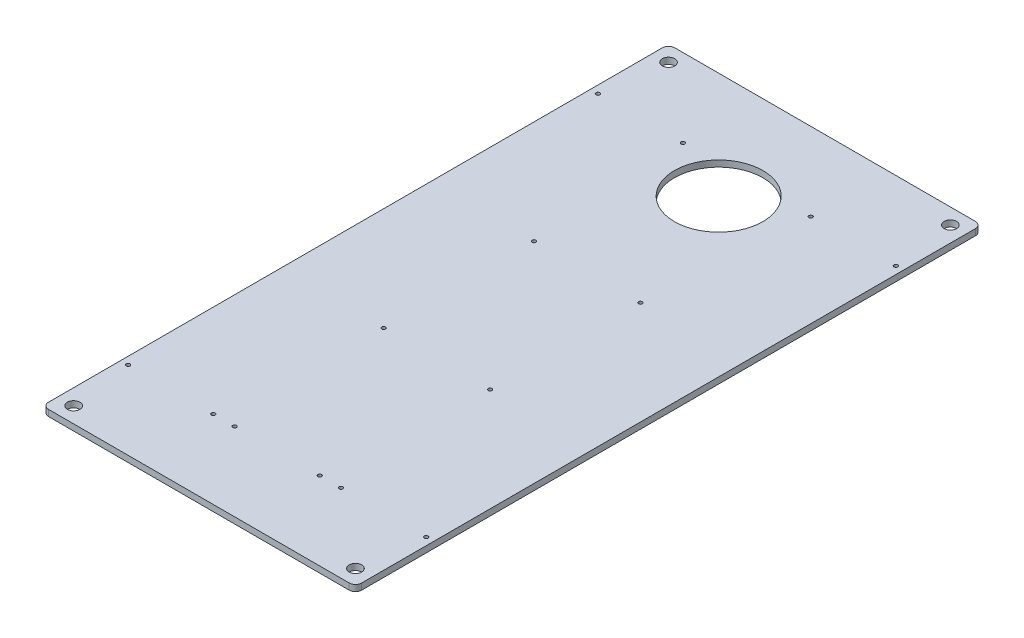
ISO-10303-21;
HEADER;
FILE_DESCRIPTION(('STEP AP214'),'2;1');
FILE_NAME('part.step','',(''),(''),'','','');
FILE_SCHEMA(('AUTOMOTIVE_DESIGN { 1 0 10303 214 1 1 1 1 }'));
ENDSEC;
DATA;
#1=APPLICATION_CONTEXT('core data for automotive mechanical design processes');
#2=APPLICATION_PROTOCOL_DEFINITION('international standard','automotive_design',2000,#1);
#3=PRODUCT_CONTEXT('',#1,'mechanical');
#4=PRODUCT('Part','Part','',(#3));
#5=PRODUCT_RELATED_PRODUCT_CATEGORY('part','',(#4));
#6=PRODUCT_DEFINITION_FORMATION('','',#4);
#7=PRODUCT_DEFINITION_CONTEXT('part definition',#1,'design');
#8=PRODUCT_DEFINITION('design','',#6,#7);
#9=PRODUCT_DEFINITION_SHAPE('','',#8);
#10=(LENGTH_UNIT() NAMED_UNIT(*) SI_UNIT(.MILLI.,.METRE.));
#11=(NAMED_UNIT(*) PLANE_ANGLE_UNIT() SI_UNIT($,.RADIAN.));
#12=(NAMED_UNIT(*) SI_UNIT($,.STERADIAN.) SOLID_ANGLE_UNIT());
#13=UNCERTAINTY_MEASURE_WITH_UNIT(LENGTH_MEASURE(1.E-05),#10,'distance_accuracy_value','');
#14=(GEOMETRIC_REPRESENTATION_CONTEXT(3) GLOBAL_UNCERTAINTY_ASSIGNED_CONTEXT((#13)) GLOBAL_UNIT_ASSIGNED_CONTEXT((#10,
#11,#12)) REPRESENTATION_CONTEXT('',''));
#15=CARTESIAN_POINT('',(0.,0.,0.));
#16=DIRECTION('',(0.,0.,1.));
#17=DIRECTION('',(1.,0.,0.));
#18=AXIS2_PLACEMENT_3D('',#15,#16,#17);
#19=CARTESIAN_POINT('',(250.,10.,500.));
#20=DIRECTION('',(-1.,0.,0.));
#21=DIRECTION('',(0.,0.,1.));
#22=AXIS2_PLACEMENT_3D('',#19,#20,#21);
#23=PLANE('',#22);
#24=DIRECTION('',(0.,0.,-1.));
#25=VECTOR('',#24,1.);
#26=CARTESIAN_POINT('',(250.,0.,500.));
#27=LINE('',#26,#25);
#28=CARTESIAN_POINT('',(250.,0.,490.));
#29=VERTEX_POINT('',#28);
#30=CARTESIAN_POINT('',(250.,0.,-490.));
#31=VERTEX_POINT('',#30);
#32=EDGE_CURVE('E158',#29,#31,#27,.T.);
#33=ORIENTED_EDGE('',*,*,#32,.T.);
#34=DIRECTION('',(0.,-1.,0.));
#35=VECTOR('',#34,1.);
#36=CARTESIAN_POINT('',(250.,10.,-490.));
#37=LINE('',#36,#35);
#38=CARTESIAN_POINT('',(250.,10.,-490.));
#39=VERTEX_POINT('',#38);
#40=EDGE_CURVE('E11',#31,#39,#37,.F.);
#41=ORIENTED_EDGE('',*,*,#40,.T.);
#42=DIRECTION('',(0.,0.,-1.));
#43=VECTOR('',#42,1.);
#44=CARTESIAN_POINT('',(250.,10.,500.));
#45=LINE('',#44,#43);
#46=CARTESIAN_POINT('',(250.,10.,490.));
#47=VERTEX_POINT('',#46);
#48=EDGE_CURVE('E126',#47,#39,#45,.T.);
#49=ORIENTED_EDGE('',*,*,#48,.F.);
#50=DIRECTION('',(0.,-1.,0.));
#51=VECTOR('',#50,1.);
#52=CARTESIAN_POINT('',(250.,10.,490.));
#53=LINE('',#52,#51);
#54=EDGE_CURVE('E42',#47,#29,#53,.T.);
#55=ORIENTED_EDGE('',*,*,#54,.T.);
#56=EDGE_LOOP('',(#33,#41,#49,#55));
#57=FACE_BOUND('',#56,.T.);
#58=ADVANCED_FACE('F34',(#57),#23,.F.);
#59=CARTESIAN_POINT('',(-250.,10.,-500.));
#60=DIRECTION('',(0.,0.,1.));
#61=DIRECTION('',(1.,0.,0.));
#62=AXIS2_PLACEMENT_3D('',#59,#60,#61);
#63=PLANE('',#62);
#64=DIRECTION('',(-1.,0.,0.));
#65=VECTOR('',#64,1.);
#66=CARTESIAN_POINT('',(-250.,0.,-500.));
#67=LINE('',#66,#65);
#68=CARTESIAN_POINT('',(240.,0.,-500.));
#69=VERTEX_POINT('',#68);
#70=CARTESIAN_POINT('',(-240.,0.,-500.));
#71=VERTEX_POINT('',#70);
#72=EDGE_CURVE('E131',#69,#71,#67,.T.);
#73=ORIENTED_EDGE('',*,*,#72,.T.);
#74=DIRECTION('',(0.,-1.,0.));
#75=VECTOR('',#74,1.);
#76=CARTESIAN_POINT('',(-240.,10.,-500.));
#77=LINE('',#76,#75);
#78=CARTESIAN_POINT('',(-240.,10.,-500.));
#79=VERTEX_POINT('',#78);
#80=EDGE_CURVE('E49',#71,#79,#77,.F.);
#81=ORIENTED_EDGE('',*,*,#80,.T.);
#82=DIRECTION('',(-1.,0.,0.));
#83=VECTOR('',#82,1.);
#84=CARTESIAN_POINT('',(-250.,10.,-500.));
#85=LINE('',#84,#83);
#86=CARTESIAN_POINT('',(240.,10.,-500.));
#87=VERTEX_POINT('',#86);
#88=EDGE_CURVE('E129',#87,#79,#85,.T.);
#89=ORIENTED_EDGE('',*,*,#88,.F.);
#90=DIRECTION('',(0.,-1.,0.));
#91=VECTOR('',#90,1.);
#92=CARTESIAN_POINT('',(240.,10.,-500.));
#93=LINE('',#92,#91);
#94=EDGE_CURVE('E150',#87,#69,#93,.T.);
#95=ORIENTED_EDGE('',*,*,#94,.T.);
#96=EDGE_LOOP('',(#73,#81,#89,#95));
#97=FACE_BOUND('',#96,.T.);
#98=ADVANCED_FACE('F324',(#97),#63,.F.);
#99=CARTESIAN_POINT('',(-250.,10.,500.));
#100=DIRECTION('',(1.,0.,0.));
#101=DIRECTION('',(0.,0.,-1.));
#102=AXIS2_PLACEMENT_3D('',#99,#100,#101);
#103=PLANE('',#102);
#104=DIRECTION('',(0.,0.,1.));
#105=VECTOR('',#104,1.);
#106=CARTESIAN_POINT('',(-250.,0.,500.));
#107=LINE('',#106,#105);
#108=CARTESIAN_POINT('',(-250.,0.,-490.));
#109=VERTEX_POINT('',#108);
#110=CARTESIAN_POINT('',(-250.,0.,490.));
#111=VERTEX_POINT('',#110);
#112=EDGE_CURVE('E127',#109,#111,#107,.T.);
#113=ORIENTED_EDGE('',*,*,#112,.T.);
#114=DIRECTION('',(0.,-1.,0.));
#115=VECTOR('',#114,1.);
#116=CARTESIAN_POINT('',(-250.,10.,490.));
#117=LINE('',#116,#115);
#118=CARTESIAN_POINT('',(-250.,10.,490.));
#119=VERTEX_POINT('',#118);
#120=EDGE_CURVE('E105',#111,#119,#117,.F.);
#121=ORIENTED_EDGE('',*,*,#120,.T.);
#122=DIRECTION('',(0.,0.,1.));
#123=VECTOR('',#122,1.);
#124=CARTESIAN_POINT('',(-250.,10.,500.));
#125=LINE('',#124,#123);
#126=CARTESIAN_POINT('',(-250.,10.,-490.));
#127=VERTEX_POINT('',#126);
#128=EDGE_CURVE('E170',#127,#119,#125,.T.);
#129=ORIENTED_EDGE('',*,*,#128,.F.);
#130=DIRECTION('',(0.,-1.,0.));
#131=VECTOR('',#130,1.);
#132=CARTESIAN_POINT('',(-250.,10.,-490.));
#133=LINE('',#132,#131);
#134=EDGE_CURVE('E110',#127,#109,#133,.T.);
#135=ORIENTED_EDGE('',*,*,#134,.T.);
#136=EDGE_LOOP('',(#113,#121,#129,#135));
#137=FACE_BOUND('',#136,.T.);
#138=ADVANCED_FACE('F321',(#137),#103,.F.);
#139=CARTESIAN_POINT('',(-250.,10.,500.));
#140=DIRECTION('',(0.,0.,-1.));
#141=DIRECTION('',(-1.,0.,0.));
#142=AXIS2_PLACEMENT_3D('',#139,#140,#141);
#143=PLANE('',#142);
#144=DIRECTION('',(1.,0.,0.));
#145=VECTOR('',#144,1.);
#146=CARTESIAN_POINT('',(-250.,10.,500.));
#147=LINE('',#146,#145);
#148=CARTESIAN_POINT('',(-240.,10.,500.));
#149=VERTEX_POINT('',#148);
#150=CARTESIAN_POINT('',(240.,10.,500.));
#151=VERTEX_POINT('',#150);
#152=EDGE_CURVE('E120',#149,#151,#147,.T.);
#153=ORIENTED_EDGE('',*,*,#152,.F.);
#154=DIRECTION('',(0.,-1.,0.));
#155=VECTOR('',#154,1.);
#156=CARTESIAN_POINT('',(-240.,10.,500.));
#157=LINE('',#156,#155);
#158=CARTESIAN_POINT('',(-240.,0.,500.));
#159=VERTEX_POINT('',#158);
#160=EDGE_CURVE('E104',#149,#159,#157,.T.);
#161=ORIENTED_EDGE('',*,*,#160,.T.);
#162=DIRECTION('',(1.,0.,0.));
#163=VECTOR('',#162,1.);
#164=CARTESIAN_POINT('',(-250.,0.,500.));
#165=LINE('',#164,#163);
#166=CARTESIAN_POINT('',(240.,0.,500.));
#167=VERTEX_POINT('',#166);
#168=EDGE_CURVE('E117',#159,#167,#165,.T.);
#169=ORIENTED_EDGE('',*,*,#168,.T.);
#170=DIRECTION('',(0.,-1.,0.));
#171=VECTOR('',#170,1.);
#172=CARTESIAN_POINT('',(240.,10.,500.));
#173=LINE('',#172,#171);
#174=EDGE_CURVE('E122',#167,#151,#173,.F.);
#175=ORIENTED_EDGE('',*,*,#174,.T.);
#176=EDGE_LOOP('',(#153,#161,#169,#175));
#177=FACE_BOUND('',#176,.T.);
#178=ADVANCED_FACE('F116',(#177),#143,.F.);
#179=CARTESIAN_POINT('',(0.,10.,0.));
#180=DIRECTION('',(0.,-1.,0.));
#181=DIRECTION('',(0.,0.,-1.));
#182=AXIS2_PLACEMENT_3D('',#179,#180,#181);
#183=PLANE('',#182);
#184=CARTESIAN_POINT('',(238.,10.,-375.));
#185=DIRECTION('',(0.,1.,0.));
#186=DIRECTION('',(0.,0.,-1.));
#187=AXIS2_PLACEMENT_3D('',#184,#185,#186);
#188=CIRCLE('',#187,2.99999999999999);
#189=CARTESIAN_POINT('',(238.,10.,-378.));
#190=VERTEX_POINT('',#189);
#191=EDGE_CURVE('E234',#190,#190,#188,.T.);
#192=ORIENTED_EDGE('',*,*,#191,.F.);
#193=EDGE_LOOP('',(#192));
#194=FACE_BOUND('',#193,.T.);
#195=CARTESIAN_POINT('',(68.,10.,375.));
#196=DIRECTION('',(0.,1.,0.));
#197=DIRECTION('',(0.,0.,1.));
#198=AXIS2_PLACEMENT_3D('',#195,#196,#197);
#199=CIRCLE('',#198,3.00000000000001);
#200=CARTESIAN_POINT('',(68.,10.,378.));
#201=VERTEX_POINT('',#200);
#202=EDGE_CURVE('E228',#201,#201,#199,.T.);
#203=ORIENTED_EDGE('',*,*,#202,.F.);
#204=EDGE_LOOP('',(#203));
#205=FACE_BOUND('',#204,.T.);
#206=CARTESIAN_POINT('',(102.,10.,375.));
#207=DIRECTION('',(0.,1.,0.));
#208=DIRECTION('',(0.,0.,-1.));
#209=AXIS2_PLACEMENT_3D('',#206,#207,#208);
#210=CIRCLE('',#209,2.99999999999999);
#211=CARTESIAN_POINT('',(102.,10.,372.));
#212=VERTEX_POINT('',#211);
#213=EDGE_CURVE('E254',#212,#212,#210,.T.);
#214=ORIENTED_EDGE('',*,*,#213,.F.);
#215=EDGE_LOOP('',(#214));
#216=FACE_BOUND('',#215,.T.);
#217=CARTESIAN_POINT('',(-68.,10.,375.));
#218=DIRECTION('',(0.,1.,0.));
#219=DIRECTION('',(0.,0.,1.));
#220=AXIS2_PLACEMENT_3D('',#217,#218,#219);
#221=CIRCLE('',#220,3.00000000000001);
#222=CARTESIAN_POINT('',(-68.,10.,378.));
#223=VERTEX_POINT('',#222);
#224=EDGE_CURVE('E248',#223,#223,#221,.T.);
#225=ORIENTED_EDGE('',*,*,#224,.F.);
#226=EDGE_LOOP('',(#225));
#227=FACE_BOUND('',#226,.T.);
#228=CARTESIAN_POINT('',(-102.,10.,375.));
#229=DIRECTION('',(0.,1.,0.));
#230=DIRECTION('',(0.,0.,1.));
#231=AXIS2_PLACEMENT_3D('',#228,#229,#230);
#232=CIRCLE('',#231,2.99999999999999);
#233=CARTESIAN_POINT('',(-102.,10.,378.));
#234=VERTEX_POINT('',#233);
#235=EDGE_CURVE('E241',#234,#234,#232,.T.);
#236=ORIENTED_EDGE('',*,*,#235,.F.);
#237=EDGE_LOOP('',(#236));
#238=FACE_BOUND('',#237,.T.);
#239=CARTESIAN_POINT('',(-238.,10.,375.));
#240=DIRECTION('',(0.,1.,0.));
#241=DIRECTION('',(0.,0.,-1.));
#242=AXIS2_PLACEMENT_3D('',#239,#240,#241);
#243=CIRCLE('',#242,2.99999999999999);
#244=CARTESIAN_POINT('',(-238.,10.,372.));
#245=VERTEX_POINT('',#244);
#246=EDGE_CURVE('E242',#245,#245,#243,.T.);
#247=ORIENTED_EDGE('',*,*,#246,.F.);
#248=EDGE_LOOP('',(#247));
#249=FACE_BOUND('',#248,.T.);
#250=CARTESIAN_POINT('',(-238.,10.,-375.));
#251=DIRECTION('',(0.,1.,0.));
#252=DIRECTION('',(0.,0.,1.));
#253=AXIS2_PLACEMENT_3D('',#250,#251,#252);
#254=CIRCLE('',#253,2.99999999999999);
#255=CARTESIAN_POINT('',(-238.,10.,-372.));
#256=VERTEX_POINT('',#255);
#257=EDGE_CURVE('E276',#256,#256,#254,.T.);
#258=ORIENTED_EDGE('',*,*,#257,.F.);
#259=EDGE_LOOP('',(#258));
#260=FACE_BOUND('',#259,.T.);
#261=CARTESIAN_POINT('',(-102.,10.,-375.));
#262=DIRECTION('',(0.,1.,0.));
#263=DIRECTION('',(0.,0.,-1.));
#264=AXIS2_PLACEMENT_3D('',#261,#262,#263);
#265=CIRCLE('',#264,2.99999999999999);
#266=CARTESIAN_POINT('',(-102.,10.,-378.));
#267=VERTEX_POINT('',#266);
#268=EDGE_CURVE('E270',#267,#267,#265,.T.);
#269=ORIENTED_EDGE('',*,*,#268,.F.);
#270=EDGE_LOOP('',(#269));
#271=FACE_BOUND('',#270,.T.);
#272=CARTESIAN_POINT('',(102.,10.,-375.));
#273=DIRECTION('',(0.,1.,0.));
#274=DIRECTION('',(0.,0.,1.));
#275=AXIS2_PLACEMENT_3D('',#272,#273,#274);
#276=CIRCLE('',#275,2.99999999999999);
#277=CARTESIAN_POINT('',(102.,10.,-372.));
#278=VERTEX_POINT('',#277);
#279=EDGE_CURVE('E264',#278,#278,#276,.T.);
#280=ORIENTED_EDGE('',*,*,#279,.F.);
#281=EDGE_LOOP('',(#280));
#282=FACE_BOUND('',#281,.T.);
#283=CARTESIAN_POINT('',(238.,10.,375.));
#284=DIRECTION('',(0.,1.,0.));
#285=DIRECTION('',(0.,0.,1.));
#286=AXIS2_PLACEMENT_3D('',#283,#284,#285);
#287=CIRCLE('',#286,2.99999999999999);
#288=CARTESIAN_POINT('',(238.,10.,378.));
#289=VERTEX_POINT('',#288);
#290=EDGE_CURVE('E211',#289,#289,#287,.T.);
#291=ORIENTED_EDGE('',*,*,#290,.F.);
#292=EDGE_LOOP('',(#291));
#293=FACE_BOUND('',#292,.T.);
#294=CARTESIAN_POINT('',(-85.,10.,120.));
#295=DIRECTION('',(0.,1.,0.));
#296=DIRECTION('',(0.,0.,1.));
#297=AXIS2_PLACEMENT_3D('',#294,#295,#296);
#298=CIRCLE('',#297,3.00000000000001);
#299=CARTESIAN_POINT('',(-85.,10.,123.));
#300=VERTEX_POINT('',#299);
#301=EDGE_CURVE('E210',#300,#300,#298,.T.);
#302=ORIENTED_EDGE('',*,*,#301,.F.);
#303=EDGE_LOOP('',(#302));
#304=FACE_BOUND('',#303,.T.);
#305=CARTESIAN_POINT('',(85.,10.,120.));
#306=DIRECTION('',(0.,1.,0.));
#307=DIRECTION('',(0.,0.,1.));
#308=AXIS2_PLACEMENT_3D('',#305,#306,#307);
#309=CIRCLE('',#308,3.00000000000001);
#310=CARTESIAN_POINT('',(85.,10.,123.));
#311=VERTEX_POINT('',#310);
#312=EDGE_CURVE('E217',#311,#311,#309,.T.);
#313=ORIENTED_EDGE('',*,*,#312,.F.);
#314=EDGE_LOOP('',(#313));
#315=FACE_BOUND('',#314,.T.);
#316=CARTESIAN_POINT('',(85.,10.,-120.));
#317=DIRECTION('',(0.,1.,0.));
#318=DIRECTION('',(0.,0.,1.));
#319=AXIS2_PLACEMENT_3D('',#316,#317,#318);
#320=CIRCLE('',#319,3.00000000000001);
#321=CARTESIAN_POINT('',(85.,10.,-117.));
#322=VERTEX_POINT('',#321);
#323=EDGE_CURVE('E204',#322,#322,#320,.T.);
#324=ORIENTED_EDGE('',*,*,#323,.F.);
#325=EDGE_LOOP('',(#324));
#326=FACE_BOUND('',#325,.T.);
#327=CARTESIAN_POINT('',(-85.,10.,-120.));
#328=DIRECTION('',(0.,1.,0.));
#329=DIRECTION('',(0.,0.,1.));
#330=AXIS2_PLACEMENT_3D('',#327,#328,#329);
#331=CIRCLE('',#330,3.00000000000001);
#332=CARTESIAN_POINT('',(-85.,10.,-117.));
#333=VERTEX_POINT('',#332);
#334=EDGE_CURVE('E198',#333,#333,#331,.T.);
#335=ORIENTED_EDGE('',*,*,#334,.F.);
#336=EDGE_LOOP('',(#335));
#337=FACE_BOUND('',#336,.T.);
#338=CARTESIAN_POINT('',(0.,10.,-330.));
#339=DIRECTION('',(0.,1.,0.));
#340=DIRECTION('',(0.,0.,1.));
#341=AXIS2_PLACEMENT_3D('',#338,#339,#340);
#342=CIRCLE('',#341,70.65);
#343=CARTESIAN_POINT('',(0.,10.,-259.35));
#344=VERTEX_POINT('',#343);
#345=EDGE_CURVE('E192',#344,#344,#342,.T.);
#346=ORIENTED_EDGE('',*,*,#345,.F.);
#347=EDGE_LOOP('',(#346));
#348=FACE_BOUND('',#347,.T.);
#349=CARTESIAN_POINT('',(225.,10.,-475.));
#350=DIRECTION('',(0.,1.,0.));
#351=DIRECTION('',(0.,0.,-1.));
#352=AXIS2_PLACEMENT_3D('',#349,#350,#351);
#353=CIRCLE('',#352,10.);
#354=CARTESIAN_POINT('',(225.,10.,-485.));
#355=VERTEX_POINT('',#354);
#356=EDGE_CURVE('E175',#355,#355,#353,.T.);
#357=ORIENTED_EDGE('',*,*,#356,.F.);
#358=EDGE_LOOP('',(#357));
#359=FACE_BOUND('',#358,.T.);
#360=CARTESIAN_POINT('',(-224.999999999999,10.,475.));
#361=DIRECTION('',(0.,1.,0.));
#362=DIRECTION('',(0.,0.,-1.));
#363=AXIS2_PLACEMENT_3D('',#360,#361,#362);
#364=CIRCLE('',#363,10.);
#365=CARTESIAN_POINT('',(-224.999999999999,10.,465.));
#366=VERTEX_POINT('',#365);
#367=EDGE_CURVE('E180',#366,#366,#364,.T.);
#368=ORIENTED_EDGE('',*,*,#367,.F.);
#369=EDGE_LOOP('',(#368));
#370=FACE_BOUND('',#369,.T.);
#371=CARTESIAN_POINT('',(225.000000000001,10.,475.));
#372=DIRECTION('',(0.,1.,0.));
#373=DIRECTION('',(0.,0.,1.));
#374=AXIS2_PLACEMENT_3D('',#371,#372,#373);
#375=CIRCLE('',#374,10.);
#376=CARTESIAN_POINT('',(225.000000000001,10.,485.));
#377=VERTEX_POINT('',#376);
#378=EDGE_CURVE('E181',#377,#377,#375,.T.);
#379=ORIENTED_EDGE('',*,*,#378,.F.);
#380=EDGE_LOOP('',(#379));
#381=FACE_BOUND('',#380,.T.);
#382=CARTESIAN_POINT('',(-225.,10.,-475.));
#383=DIRECTION('',(0.,1.,0.));
#384=DIRECTION('',(0.,0.,1.));
#385=AXIS2_PLACEMENT_3D('',#382,#383,#384);
#386=CIRCLE('',#385,10.);
#387=CARTESIAN_POINT('',(-225.,10.,-465.));
#388=VERTEX_POINT('',#387);
#389=EDGE_CURVE('E163',#388,#388,#386,.T.);
#390=ORIENTED_EDGE('',*,*,#389,.F.);
#391=EDGE_LOOP('',(#390));
#392=FACE_BOUND('',#391,.T.);
#393=ORIENTED_EDGE('',*,*,#128,.T.);
#394=CARTESIAN_POINT('',(-240.,10.,490.));
#395=DIRECTION('',(0.,-1.,0.));
#396=DIRECTION('',(0.,0.,-1.));
#397=AXIS2_PLACEMENT_3D('',#394,#395,#396);
#398=CIRCLE('',#397,10.);
#399=EDGE_CURVE('E148',#119,#149,#398,.F.);
#400=ORIENTED_EDGE('',*,*,#399,.T.);
#401=ORIENTED_EDGE('',*,*,#152,.T.);
#402=CARTESIAN_POINT('',(240.,10.,490.));
#403=DIRECTION('',(0.,-1.,0.));
#404=DIRECTION('',(0.,0.,-1.));
#405=AXIS2_PLACEMENT_3D('',#402,#403,#404);
#406=CIRCLE('',#405,10.);
#407=EDGE_CURVE('E143',#151,#47,#406,.F.);
#408=ORIENTED_EDGE('',*,*,#407,.T.);
#409=ORIENTED_EDGE('',*,*,#48,.T.);
#410=CARTESIAN_POINT('',(240.,10.,-490.));
#411=DIRECTION('',(0.,-1.,0.));
#412=DIRECTION('',(0.,0.,-1.));
#413=AXIS2_PLACEMENT_3D('',#410,#411,#412);
#414=CIRCLE('',#413,10.);
#415=EDGE_CURVE('E56',#39,#87,#414,.F.);
#416=ORIENTED_EDGE('',*,*,#415,.T.);
#417=ORIENTED_EDGE('',*,*,#88,.T.);
#418=CARTESIAN_POINT('',(-240.,10.,-490.));
#419=DIRECTION('',(0.,-1.,0.));
#420=DIRECTION('',(0.,0.,-1.));
#421=AXIS2_PLACEMENT_3D('',#418,#419,#420);
#422=CIRCLE('',#421,10.);
#423=EDGE_CURVE('E146',#79,#127,#422,.F.);
#424=ORIENTED_EDGE('',*,*,#423,.T.);
#425=EDGE_LOOP('',(#393,#400,#401,#408,#409,#416,#417,#424));
#426=FACE_BOUND('',#425,.T.);
#427=ADVANCED_FACE('F287',(#194,#205,#216,#227,#238,#249,#260,#271,#282,#293,#304,#315,#326,
#337,#348,#359,#370,#381,#392,#426),#183,.F.);
#428=CARTESIAN_POINT('',(0.,0.,0.));
#429=DIRECTION('',(0.,-1.,0.));
#430=DIRECTION('',(0.,0.,-1.));
#431=AXIS2_PLACEMENT_3D('',#428,#429,#430);
#432=PLANE('',#431);
#433=CARTESIAN_POINT('',(238.,0.,-375.));
#434=DIRECTION('',(0.,-1.,0.));
#435=DIRECTION('',(0.,0.,-1.));
#436=AXIS2_PLACEMENT_3D('',#433,#434,#435);
#437=CIRCLE('',#436,2.99999999999999);
#438=CARTESIAN_POINT('',(238.,0.,-378.));
#439=VERTEX_POINT('',#438);
#440=EDGE_CURVE('E231',#439,#439,#437,.F.);
#441=ORIENTED_EDGE('',*,*,#440,.T.);
#442=EDGE_LOOP('',(#441));
#443=FACE_BOUND('',#442,.T.);
#444=CARTESIAN_POINT('',(68.,0.,375.));
#445=DIRECTION('',(0.,-1.,0.));
#446=DIRECTION('',(0.,0.,-1.));
#447=AXIS2_PLACEMENT_3D('',#444,#445,#446);
#448=CIRCLE('',#447,3.00000000000001);
#449=CARTESIAN_POINT('',(68.,0.,372.));
#450=VERTEX_POINT('',#449);
#451=EDGE_CURVE('E257',#450,#450,#448,.F.);
#452=ORIENTED_EDGE('',*,*,#451,.T.);
#453=EDGE_LOOP('',(#452));
#454=FACE_BOUND('',#453,.T.);
#455=CARTESIAN_POINT('',(102.,0.,375.));
#456=DIRECTION('',(0.,-1.,0.));
#457=DIRECTION('',(0.,0.,-1.));
#458=AXIS2_PLACEMENT_3D('',#455,#456,#457);
#459=CIRCLE('',#458,2.99999999999999);
#460=CARTESIAN_POINT('',(102.,0.,372.));
#461=VERTEX_POINT('',#460);
#462=EDGE_CURVE('E251',#461,#461,#459,.F.);
#463=ORIENTED_EDGE('',*,*,#462,.T.);
#464=EDGE_LOOP('',(#463));
#465=FACE_BOUND('',#464,.T.);
#466=CARTESIAN_POINT('',(-68.,0.,375.));
#467=DIRECTION('',(0.,-1.,0.));
#468=DIRECTION('',(0.,0.,-1.));
#469=AXIS2_PLACEMENT_3D('',#466,#467,#468);
#470=CIRCLE('',#469,3.00000000000001);
#471=CARTESIAN_POINT('',(-68.,0.,372.));
#472=VERTEX_POINT('',#471);
#473=EDGE_CURVE('E245',#472,#472,#470,.F.);
#474=ORIENTED_EDGE('',*,*,#473,.T.);
#475=EDGE_LOOP('',(#474));
#476=FACE_BOUND('',#475,.T.);
#477=CARTESIAN_POINT('',(-102.,0.,375.));
#478=DIRECTION('',(0.,-1.,0.));
#479=DIRECTION('',(0.,0.,-1.));
#480=AXIS2_PLACEMENT_3D('',#477,#478,#479);
#481=CIRCLE('',#480,2.99999999999999);
#482=CARTESIAN_POINT('',(-102.,0.,372.));
#483=VERTEX_POINT('',#482);
#484=EDGE_CURVE('E238',#483,#483,#481,.F.);
#485=ORIENTED_EDGE('',*,*,#484,.T.);
#486=EDGE_LOOP('',(#485));
#487=FACE_BOUND('',#486,.T.);
#488=CARTESIAN_POINT('',(-238.,0.,375.));
#489=DIRECTION('',(0.,-1.,0.));
#490=DIRECTION('',(0.,0.,-1.));
#491=AXIS2_PLACEMENT_3D('',#488,#489,#490);
#492=CIRCLE('',#491,2.99999999999999);
#493=CARTESIAN_POINT('',(-238.,0.,372.));
#494=VERTEX_POINT('',#493);
#495=EDGE_CURVE('E279',#494,#494,#492,.F.);
#496=ORIENTED_EDGE('',*,*,#495,.T.);
#497=EDGE_LOOP('',(#496));
#498=FACE_BOUND('',#497,.T.);
#499=CARTESIAN_POINT('',(-238.,0.,-375.));
#500=DIRECTION('',(0.,-1.,0.));
#501=DIRECTION('',(0.,0.,-1.));
#502=AXIS2_PLACEMENT_3D('',#499,#500,#501);
#503=CIRCLE('',#502,2.99999999999999);
#504=CARTESIAN_POINT('',(-238.,0.,-378.));
#505=VERTEX_POINT('',#504);
#506=EDGE_CURVE('E273',#505,#505,#503,.F.);
#507=ORIENTED_EDGE('',*,*,#506,.T.);
#508=EDGE_LOOP('',(#507));
#509=FACE_BOUND('',#508,.T.);
#510=CARTESIAN_POINT('',(-102.,0.,-375.));
#511=DIRECTION('',(0.,-1.,0.));
#512=DIRECTION('',(0.,0.,-1.));
#513=AXIS2_PLACEMENT_3D('',#510,#511,#512);
#514=CIRCLE('',#513,2.99999999999999);
#515=CARTESIAN_POINT('',(-102.,0.,-378.));
#516=VERTEX_POINT('',#515);
#517=EDGE_CURVE('E267',#516,#516,#514,.F.);
#518=ORIENTED_EDGE('',*,*,#517,.T.);
#519=EDGE_LOOP('',(#518));
#520=FACE_BOUND('',#519,.T.);
#521=CARTESIAN_POINT('',(102.,0.,-375.));
#522=DIRECTION('',(0.,-1.,0.));
#523=DIRECTION('',(0.,0.,-1.));
#524=AXIS2_PLACEMENT_3D('',#521,#522,#523);
#525=CIRCLE('',#524,2.99999999999999);
#526=CARTESIAN_POINT('',(102.,0.,-378.));
#527=VERTEX_POINT('',#526);
#528=EDGE_CURVE('E237',#527,#527,#525,.F.);
#529=ORIENTED_EDGE('',*,*,#528,.T.);
#530=EDGE_LOOP('',(#529));
#531=FACE_BOUND('',#530,.T.);
#532=CARTESIAN_POINT('',(238.,0.,375.));
#533=DIRECTION('',(0.,-1.,0.));
#534=DIRECTION('',(0.,0.,-1.));
#535=AXIS2_PLACEMENT_3D('',#532,#533,#534);
#536=CIRCLE('',#535,2.99999999999999);
#537=CARTESIAN_POINT('',(238.,0.,372.));
#538=VERTEX_POINT('',#537);
#539=EDGE_CURVE('E225',#538,#538,#536,.F.);
#540=ORIENTED_EDGE('',*,*,#539,.T.);
#541=EDGE_LOOP('',(#540));
#542=FACE_BOUND('',#541,.T.);
#543=CARTESIAN_POINT('',(-85.,0.,120.));
#544=DIRECTION('',(0.,-1.,0.));
#545=DIRECTION('',(0.,0.,-1.));
#546=AXIS2_PLACEMENT_3D('',#543,#544,#545);
#547=CIRCLE('',#546,3.00000000000001);
#548=CARTESIAN_POINT('',(-85.,0.,117.));
#549=VERTEX_POINT('',#548);
#550=EDGE_CURVE('E207',#549,#549,#547,.F.);
#551=ORIENTED_EDGE('',*,*,#550,.T.);
#552=EDGE_LOOP('',(#551));
#553=FACE_BOUND('',#552,.T.);
#554=CARTESIAN_POINT('',(85.,0.,120.));
#555=DIRECTION('',(0.,-1.,0.));
#556=DIRECTION('',(0.,0.,-1.));
#557=AXIS2_PLACEMENT_3D('',#554,#555,#556);
#558=CIRCLE('',#557,3.00000000000001);
#559=CARTESIAN_POINT('',(85.,0.,117.));
#560=VERTEX_POINT('',#559);
#561=EDGE_CURVE('E214',#560,#560,#558,.F.);
#562=ORIENTED_EDGE('',*,*,#561,.T.);
#563=EDGE_LOOP('',(#562));
#564=FACE_BOUND('',#563,.T.);
#565=CARTESIAN_POINT('',(85.,0.,-120.));
#566=DIRECTION('',(0.,-1.,0.));
#567=DIRECTION('',(0.,0.,-1.));
#568=AXIS2_PLACEMENT_3D('',#565,#566,#567);
#569=CIRCLE('',#568,3.00000000000001);
#570=CARTESIAN_POINT('',(85.,0.,-123.));
#571=VERTEX_POINT('',#570);
#572=EDGE_CURVE('E220',#571,#571,#569,.F.);
#573=ORIENTED_EDGE('',*,*,#572,.T.);
#574=EDGE_LOOP('',(#573));
#575=FACE_BOUND('',#574,.T.);
#576=CARTESIAN_POINT('',(-85.,0.,-120.));
#577=DIRECTION('',(0.,-1.,0.));
#578=DIRECTION('',(0.,0.,-1.));
#579=AXIS2_PLACEMENT_3D('',#576,#577,#578);
#580=CIRCLE('',#579,3.00000000000001);
#581=CARTESIAN_POINT('',(-85.,0.,-123.));
#582=VERTEX_POINT('',#581);
#583=EDGE_CURVE('E201',#582,#582,#580,.F.);
#584=ORIENTED_EDGE('',*,*,#583,.T.);
#585=EDGE_LOOP('',(#584));
#586=FACE_BOUND('',#585,.T.);
#587=CARTESIAN_POINT('',(0.,0.,-330.));
#588=DIRECTION('',(0.,-1.,0.));
#589=DIRECTION('',(0.,0.,-1.));
#590=AXIS2_PLACEMENT_3D('',#587,#588,#589);
#591=CIRCLE('',#590,70.65);
#592=CARTESIAN_POINT('',(0.,0.,-400.65));
#593=VERTEX_POINT('',#592);
#594=EDGE_CURVE('E195',#593,#593,#591,.F.);
#595=ORIENTED_EDGE('',*,*,#594,.T.);
#596=EDGE_LOOP('',(#595));
#597=FACE_BOUND('',#596,.T.);
#598=CARTESIAN_POINT('',(225.,0.,-475.));
#599=DIRECTION('',(0.,-1.,0.));
#600=DIRECTION('',(0.,0.,-1.));
#601=AXIS2_PLACEMENT_3D('',#598,#599,#600);
#602=CIRCLE('',#601,10.);
#603=CARTESIAN_POINT('',(225.,0.,-485.));
#604=VERTEX_POINT('',#603);
#605=EDGE_CURVE('E184',#604,#604,#602,.F.);
#606=ORIENTED_EDGE('',*,*,#605,.T.);
#607=EDGE_LOOP('',(#606));
#608=FACE_BOUND('',#607,.T.);
#609=CARTESIAN_POINT('',(-224.999999999999,0.,475.));
#610=DIRECTION('',(0.,-1.,0.));
#611=DIRECTION('',(0.,0.,-1.));
#612=AXIS2_PLACEMENT_3D('',#609,#610,#611);
#613=CIRCLE('',#612,10.);
#614=CARTESIAN_POINT('',(-224.999999999999,0.,465.));
#615=VERTEX_POINT('',#614);
#616=EDGE_CURVE('E177',#615,#615,#613,.F.);
#617=ORIENTED_EDGE('',*,*,#616,.T.);
#618=EDGE_LOOP('',(#617));
#619=FACE_BOUND('',#618,.T.);
#620=CARTESIAN_POINT('',(225.000000000001,0.,475.));
#621=DIRECTION('',(0.,-1.,0.));
#622=DIRECTION('',(0.,0.,-1.));
#623=AXIS2_PLACEMENT_3D('',#620,#621,#622);
#624=CIRCLE('',#623,10.);
#625=CARTESIAN_POINT('',(225.000000000001,0.,465.));
#626=VERTEX_POINT('',#625);
#627=EDGE_CURVE('E189',#626,#626,#624,.F.);
#628=ORIENTED_EDGE('',*,*,#627,.T.);
#629=EDGE_LOOP('',(#628));
#630=FACE_BOUND('',#629,.T.);
#631=CARTESIAN_POINT('',(-225.,0.,-475.));
#632=DIRECTION('',(0.,-1.,0.));
#633=DIRECTION('',(0.,0.,-1.));
#634=AXIS2_PLACEMENT_3D('',#631,#632,#633);
#635=CIRCLE('',#634,10.);
#636=CARTESIAN_POINT('',(-225.,0.,-485.));
#637=VERTEX_POINT('',#636);
#638=EDGE_CURVE('E166',#637,#637,#635,.F.);
#639=ORIENTED_EDGE('',*,*,#638,.T.);
#640=EDGE_LOOP('',(#639));
#641=FACE_BOUND('',#640,.T.);
#642=ORIENTED_EDGE('',*,*,#168,.F.);
#643=CARTESIAN_POINT('',(-240.,0.,490.));
#644=DIRECTION('',(0.,-1.,0.));
#645=DIRECTION('',(0.,0.,-1.));
#646=AXIS2_PLACEMENT_3D('',#643,#644,#645);
#647=CIRCLE('',#646,10.);
#648=EDGE_CURVE('E100',#159,#111,#647,.T.);
#649=ORIENTED_EDGE('',*,*,#648,.T.);
#650=ORIENTED_EDGE('',*,*,#112,.F.);
#651=CARTESIAN_POINT('',(-240.,0.,-490.));
#652=DIRECTION('',(0.,-1.,0.));
#653=DIRECTION('',(0.,0.,-1.));
#654=AXIS2_PLACEMENT_3D('',#651,#652,#653);
#655=CIRCLE('',#654,10.);
#656=EDGE_CURVE('E111',#109,#71,#655,.T.);
#657=ORIENTED_EDGE('',*,*,#656,.T.);
#658=ORIENTED_EDGE('',*,*,#72,.F.);
#659=CARTESIAN_POINT('',(240.,0.,-490.));
#660=DIRECTION('',(0.,-1.,0.));
#661=DIRECTION('',(0.,0.,-1.));
#662=AXIS2_PLACEMENT_3D('',#659,#660,#661);
#663=CIRCLE('',#662,10.);
#664=EDGE_CURVE('E137',#69,#31,#663,.T.);
#665=ORIENTED_EDGE('',*,*,#664,.T.);
#666=ORIENTED_EDGE('',*,*,#32,.F.);
#667=CARTESIAN_POINT('',(240.,0.,490.));
#668=DIRECTION('',(0.,-1.,0.));
#669=DIRECTION('',(0.,0.,-1.));
#670=AXIS2_PLACEMENT_3D('',#667,#668,#669);
#671=CIRCLE('',#670,10.);
#672=EDGE_CURVE('E121',#29,#167,#671,.T.);
#673=ORIENTED_EDGE('',*,*,#672,.T.);
#674=EDGE_LOOP('',(#642,#649,#650,#657,#658,#665,#666,#673));
#675=FACE_BOUND('',#674,.T.);
#676=ADVANCED_FACE('F124',(#443,#454,#465,#476,#487,#498,#509,#520,#531,#542,#553,#564,#575,
#586,#597,#608,#619,#630,#641,#675),#432,.T.);
#677=CARTESIAN_POINT('',(-225.,-0.000999999999999265,-475.));
#678=DIRECTION('',(0.,1.,0.));
#679=DIRECTION('',(0.,0.,1.));
#680=AXIS2_PLACEMENT_3D('',#677,#678,#679);
#681=CYLINDRICAL_SURFACE('',#680,10.);
#682=ORIENTED_EDGE('',*,*,#638,.F.);
#683=EDGE_LOOP('',(#682));
#684=FACE_BOUND('',#683,.T.);
#685=ORIENTED_EDGE('',*,*,#389,.T.);
#686=EDGE_LOOP('',(#685));
#687=FACE_BOUND('',#686,.T.);
#688=ADVANCED_FACE('F427',(#684,#687),#681,.F.);
#689=CARTESIAN_POINT('',(225.000000000001,-0.000999999999999265,475.));
#690=DIRECTION('',(0.,1.,0.));
#691=DIRECTION('',(0.,0.,1.));
#692=AXIS2_PLACEMENT_3D('',#689,#690,#691);
#693=CYLINDRICAL_SURFACE('',#692,10.);
#694=ORIENTED_EDGE('',*,*,#627,.F.);
#695=EDGE_LOOP('',(#694));
#696=FACE_BOUND('',#695,.T.);
#697=ORIENTED_EDGE('',*,*,#378,.T.);
#698=EDGE_LOOP('',(#697));
#699=FACE_BOUND('',#698,.T.);
#700=ADVANCED_FACE('F533',(#696,#699),#693,.F.);
#701=CARTESIAN_POINT('',(-224.999999999999,-0.000999999999999265,475.));
#702=DIRECTION('',(0.,1.,0.));
#703=DIRECTION('',(0.,0.,1.));
#704=AXIS2_PLACEMENT_3D('',#701,#702,#703);
#705=CYLINDRICAL_SURFACE('',#704,10.);
#706=ORIENTED_EDGE('',*,*,#616,.F.);
#707=EDGE_LOOP('',(#706));
#708=FACE_BOUND('',#707,.T.);
#709=ORIENTED_EDGE('',*,*,#367,.T.);
#710=EDGE_LOOP('',(#709));
#711=FACE_BOUND('',#710,.T.);
#712=ADVANCED_FACE('F536',(#708,#711),#705,.F.);
#713=CARTESIAN_POINT('',(225.,-0.000999999999999265,-475.));
#714=DIRECTION('',(0.,1.,0.));
#715=DIRECTION('',(0.,0.,1.));
#716=AXIS2_PLACEMENT_3D('',#713,#714,#715);
#717=CYLINDRICAL_SURFACE('',#716,10.);
#718=ORIENTED_EDGE('',*,*,#605,.F.);
#719=EDGE_LOOP('',(#718));
#720=FACE_BOUND('',#719,.T.);
#721=ORIENTED_EDGE('',*,*,#356,.T.);
#722=EDGE_LOOP('',(#721));
#723=FACE_BOUND('',#722,.T.);
#724=ADVANCED_FACE('F347',(#720,#723),#717,.F.);
#725=CARTESIAN_POINT('',(-240.,10.,490.));
#726=DIRECTION('',(0.,-1.,0.));
#727=DIRECTION('',(0.,0.,-1.));
#728=AXIS2_PLACEMENT_3D('',#725,#726,#727);
#729=CYLINDRICAL_SURFACE('',#728,10.);
#730=ORIENTED_EDGE('',*,*,#399,.F.);
#731=ORIENTED_EDGE('',*,*,#120,.F.);
#732=ORIENTED_EDGE('',*,*,#648,.F.);
#733=ORIENTED_EDGE('',*,*,#160,.F.);
#734=EDGE_LOOP('',(#730,#731,#732,#733));
#735=FACE_BOUND('',#734,.T.);
#736=ADVANCED_FACE('F103',(#735),#729,.T.);
#737=CARTESIAN_POINT('',(-240.,10.,-490.));
#738=DIRECTION('',(0.,-1.,0.));
#739=DIRECTION('',(0.,0.,-1.));
#740=AXIS2_PLACEMENT_3D('',#737,#738,#739);
#741=CYLINDRICAL_SURFACE('',#740,10.);
#742=ORIENTED_EDGE('',*,*,#423,.F.);
#743=ORIENTED_EDGE('',*,*,#80,.F.);
#744=ORIENTED_EDGE('',*,*,#656,.F.);
#745=ORIENTED_EDGE('',*,*,#134,.F.);
#746=EDGE_LOOP('',(#742,#743,#744,#745));
#747=FACE_BOUND('',#746,.T.);
#748=ADVANCED_FACE('F323',(#747),#741,.T.);
#749=CARTESIAN_POINT('',(240.,10.,-490.));
#750=DIRECTION('',(0.,-1.,0.));
#751=DIRECTION('',(0.,0.,-1.));
#752=AXIS2_PLACEMENT_3D('',#749,#750,#751);
#753=CYLINDRICAL_SURFACE('',#752,10.);
#754=ORIENTED_EDGE('',*,*,#415,.F.);
#755=ORIENTED_EDGE('',*,*,#40,.F.);
#756=ORIENTED_EDGE('',*,*,#664,.F.);
#757=ORIENTED_EDGE('',*,*,#94,.F.);
#758=EDGE_LOOP('',(#754,#755,#756,#757));
#759=FACE_BOUND('',#758,.T.);
#760=ADVANCED_FACE('F327',(#759),#753,.T.);
#761=CARTESIAN_POINT('',(240.,10.,490.));
#762=DIRECTION('',(0.,-1.,0.));
#763=DIRECTION('',(0.,0.,-1.));
#764=AXIS2_PLACEMENT_3D('',#761,#762,#763);
#765=CYLINDRICAL_SURFACE('',#764,10.);
#766=ORIENTED_EDGE('',*,*,#407,.F.);
#767=ORIENTED_EDGE('',*,*,#174,.F.);
#768=ORIENTED_EDGE('',*,*,#672,.F.);
#769=ORIENTED_EDGE('',*,*,#54,.F.);
#770=EDGE_LOOP('',(#766,#767,#768,#769));
#771=FACE_BOUND('',#770,.T.);
#772=ADVANCED_FACE('F36',(#771),#765,.T.);
#773=CARTESIAN_POINT('',(0.,-0.000999999999999265,-330.));
#774=DIRECTION('',(0.,1.,0.));
#775=DIRECTION('',(0.,0.,1.));
#776=AXIS2_PLACEMENT_3D('',#773,#774,#775);
#777=CYLINDRICAL_SURFACE('',#776,70.65);
#778=ORIENTED_EDGE('',*,*,#594,.F.);
#779=EDGE_LOOP('',(#778));
#780=FACE_BOUND('',#779,.T.);
#781=ORIENTED_EDGE('',*,*,#345,.T.);
#782=EDGE_LOOP('',(#781));
#783=FACE_BOUND('',#782,.T.);
#784=ADVANCED_FACE('F329',(#780,#783),#777,.F.);
#785=CARTESIAN_POINT('',(-85.,-0.000999999999999265,-120.));
#786=DIRECTION('',(0.,1.,0.));
#787=DIRECTION('',(0.,0.,1.));
#788=AXIS2_PLACEMENT_3D('',#785,#786,#787);
#789=CYLINDRICAL_SURFACE('',#788,3.00000000000001);
#790=ORIENTED_EDGE('',*,*,#583,.F.);
#791=EDGE_LOOP('',(#790));
#792=FACE_BOUND('',#791,.T.);
#793=ORIENTED_EDGE('',*,*,#334,.T.);
#794=EDGE_LOOP('',(#793));
#795=FACE_BOUND('',#794,.T.);
#796=ADVANCED_FACE('F334',(#792,#795),#789,.F.);
#797=CARTESIAN_POINT('',(85.,-0.000999999999999265,-120.));
#798=DIRECTION('',(0.,1.,0.));
#799=DIRECTION('',(0.,0.,1.));
#800=AXIS2_PLACEMENT_3D('',#797,#798,#799);
#801=CYLINDRICAL_SURFACE('',#800,3.00000000000001);
#802=ORIENTED_EDGE('',*,*,#572,.F.);
#803=EDGE_LOOP('',(#802));
#804=FACE_BOUND('',#803,.T.);
#805=ORIENTED_EDGE('',*,*,#323,.T.);
#806=EDGE_LOOP('',(#805));
#807=FACE_BOUND('',#806,.T.);
#808=ADVANCED_FACE('F377',(#804,#807),#801,.F.);
#809=CARTESIAN_POINT('',(85.,-0.000999999999999265,120.));
#810=DIRECTION('',(0.,1.,0.));
#811=DIRECTION('',(0.,0.,1.));
#812=AXIS2_PLACEMENT_3D('',#809,#810,#811);
#813=CYLINDRICAL_SURFACE('',#812,3.00000000000001);
#814=ORIENTED_EDGE('',*,*,#561,.F.);
#815=EDGE_LOOP('',(#814));
#816=FACE_BOUND('',#815,.T.);
#817=ORIENTED_EDGE('',*,*,#312,.T.);
#818=EDGE_LOOP('',(#817));
#819=FACE_BOUND('',#818,.T.);
#820=ADVANCED_FACE('F387',(#816,#819),#813,.F.);
#821=CARTESIAN_POINT('',(-85.,-0.000999999999999265,120.));
#822=DIRECTION('',(0.,1.,0.));
#823=DIRECTION('',(0.,0.,1.));
#824=AXIS2_PLACEMENT_3D('',#821,#822,#823);
#825=CYLINDRICAL_SURFACE('',#824,3.00000000000001);
#826=ORIENTED_EDGE('',*,*,#550,.F.);
#827=EDGE_LOOP('',(#826));
#828=FACE_BOUND('',#827,.T.);
#829=ORIENTED_EDGE('',*,*,#301,.T.);
#830=EDGE_LOOP('',(#829));
#831=FACE_BOUND('',#830,.T.);
#832=ADVANCED_FACE('F397',(#828,#831),#825,.F.);
#833=CARTESIAN_POINT('',(238.,-0.000999999999999265,375.));
#834=DIRECTION('',(0.,1.,0.));
#835=DIRECTION('',(0.,0.,1.));
#836=AXIS2_PLACEMENT_3D('',#833,#834,#835);
#837=CYLINDRICAL_SURFACE('',#836,2.99999999999999);
#838=ORIENTED_EDGE('',*,*,#539,.F.);
#839=EDGE_LOOP('',(#838));
#840=FACE_BOUND('',#839,.T.);
#841=ORIENTED_EDGE('',*,*,#290,.T.);
#842=EDGE_LOOP('',(#841));
#843=FACE_BOUND('',#842,.T.);
#844=ADVANCED_FACE('F407',(#840,#843),#837,.F.);
#845=CARTESIAN_POINT('',(102.,-0.000999999999999265,-375.));
#846=DIRECTION('',(0.,1.,0.));
#847=DIRECTION('',(0.,0.,1.));
#848=AXIS2_PLACEMENT_3D('',#845,#846,#847);
#849=CYLINDRICAL_SURFACE('',#848,2.99999999999999);
#850=ORIENTED_EDGE('',*,*,#528,.F.);
#851=EDGE_LOOP('',(#850));
#852=FACE_BOUND('',#851,.T.);
#853=ORIENTED_EDGE('',*,*,#279,.T.);
#854=EDGE_LOOP('',(#853));
#855=FACE_BOUND('',#854,.T.);
#856=ADVANCED_FACE('F437',(#852,#855),#849,.F.);
#857=CARTESIAN_POINT('',(-102.,-0.000999999999999265,-375.));
#858=DIRECTION('',(0.,1.,0.));
#859=DIRECTION('',(0.,0.,1.));
#860=AXIS2_PLACEMENT_3D('',#857,#858,#859);
#861=CYLINDRICAL_SURFACE('',#860,2.99999999999999);
#862=ORIENTED_EDGE('',*,*,#517,.F.);
#863=EDGE_LOOP('',(#862));
#864=FACE_BOUND('',#863,.T.);
#865=ORIENTED_EDGE('',*,*,#268,.T.);
#866=EDGE_LOOP('',(#865));
#867=FACE_BOUND('',#866,.T.);
#868=ADVANCED_FACE('F447',(#864,#867),#861,.F.);
#869=CARTESIAN_POINT('',(-238.,-0.000999999999999265,-375.));
#870=DIRECTION('',(0.,1.,0.));
#871=DIRECTION('',(0.,0.,1.));
#872=AXIS2_PLACEMENT_3D('',#869,#870,#871);
#873=CYLINDRICAL_SURFACE('',#872,2.99999999999999);
#874=ORIENTED_EDGE('',*,*,#506,.F.);
#875=EDGE_LOOP('',(#874));
#876=FACE_BOUND('',#875,.T.);
#877=ORIENTED_EDGE('',*,*,#257,.T.);
#878=EDGE_LOOP('',(#877));
#879=FACE_BOUND('',#878,.T.);
#880=ADVANCED_FACE('F457',(#876,#879),#873,.F.);
#881=CARTESIAN_POINT('',(-238.,-0.000999999999999265,375.));
#882=DIRECTION('',(0.,1.,0.));
#883=DIRECTION('',(0.,0.,1.));
#884=AXIS2_PLACEMENT_3D('',#881,#882,#883);
#885=CYLINDRICAL_SURFACE('',#884,2.99999999999999);
#886=ORIENTED_EDGE('',*,*,#495,.F.);
#887=EDGE_LOOP('',(#886));
#888=FACE_BOUND('',#887,.T.);
#889=ORIENTED_EDGE('',*,*,#246,.T.);
#890=EDGE_LOOP('',(#889));
#891=FACE_BOUND('',#890,.T.);
#892=ADVANCED_FACE('F285',(#888,#891),#885,.F.);
#893=CARTESIAN_POINT('',(-102.,-0.000999999999999265,375.));
#894=DIRECTION('',(0.,1.,0.));
#895=DIRECTION('',(0.,0.,1.));
#896=AXIS2_PLACEMENT_3D('',#893,#894,#895);
#897=CYLINDRICAL_SURFACE('',#896,2.99999999999999);
#898=ORIENTED_EDGE('',*,*,#484,.F.);
#899=EDGE_LOOP('',(#898));
#900=FACE_BOUND('',#899,.T.);
#901=ORIENTED_EDGE('',*,*,#235,.T.);
#902=EDGE_LOOP('',(#901));
#903=FACE_BOUND('',#902,.T.);
#904=ADVANCED_FACE('F476',(#900,#903),#897,.F.);
#905=CARTESIAN_POINT('',(-68.,-0.000999999999999265,375.));
#906=DIRECTION('',(0.,1.,0.));
#907=DIRECTION('',(0.,0.,1.));
#908=AXIS2_PLACEMENT_3D('',#905,#906,#907);
#909=CYLINDRICAL_SURFACE('',#908,3.00000000000001);
#910=ORIENTED_EDGE('',*,*,#473,.F.);
#911=EDGE_LOOP('',(#910));
#912=FACE_BOUND('',#911,.T.);
#913=ORIENTED_EDGE('',*,*,#224,.T.);
#914=EDGE_LOOP('',(#913));
#915=FACE_BOUND('',#914,.T.);
#916=ADVANCED_FACE('F486',(#912,#915),#909,.F.);
#917=CARTESIAN_POINT('',(102.,-0.000999999999999265,375.));
#918=DIRECTION('',(0.,1.,0.));
#919=DIRECTION('',(0.,0.,1.));
#920=AXIS2_PLACEMENT_3D('',#917,#918,#919);
#921=CYLINDRICAL_SURFACE('',#920,2.99999999999999);
#922=ORIENTED_EDGE('',*,*,#462,.F.);
#923=EDGE_LOOP('',(#922));
#924=FACE_BOUND('',#923,.T.);
#925=ORIENTED_EDGE('',*,*,#213,.T.);
#926=EDGE_LOOP('',(#925));
#927=FACE_BOUND('',#926,.T.);
#928=ADVANCED_FACE('F496',(#924,#927),#921,.F.);
#929=CARTESIAN_POINT('',(68.,-0.000999999999999265,375.));
#930=DIRECTION('',(0.,1.,0.));
#931=DIRECTION('',(0.,0.,1.));
#932=AXIS2_PLACEMENT_3D('',#929,#930,#931);
#933=CYLINDRICAL_SURFACE('',#932,3.00000000000001);
#934=ORIENTED_EDGE('',*,*,#451,.F.);
#935=EDGE_LOOP('',(#934));
#936=FACE_BOUND('',#935,.T.);
#937=ORIENTED_EDGE('',*,*,#202,.T.);
#938=EDGE_LOOP('',(#937));
#939=FACE_BOUND('',#938,.T.);
#940=ADVANCED_FACE('F506',(#936,#939),#933,.F.);
#941=CARTESIAN_POINT('',(238.,-0.000999999999999265,-375.));
#942=DIRECTION('',(0.,1.,0.));
#943=DIRECTION('',(0.,0.,1.));
#944=AXIS2_PLACEMENT_3D('',#941,#942,#943);
#945=CYLINDRICAL_SURFACE('',#944,2.99999999999999);
#946=ORIENTED_EDGE('',*,*,#440,.F.);
#947=EDGE_LOOP('',(#946));
#948=FACE_BOUND('',#947,.T.);
#949=ORIENTED_EDGE('',*,*,#191,.T.);
#950=EDGE_LOOP('',(#949));
#951=FACE_BOUND('',#950,.T.);
#952=ADVANCED_FACE('F516',(#948,#951),#945,.F.);
#953=CLOSED_SHELL('',(#58,#98,#138,#178,#427,#676,#688,#700,#712,#724,#736,#748,#760,#772,#784,
#796,#808,#820,#832,#844,#856,#868,#880,#892,#904,#916,#928,#940,#952));
#954=MANIFOLD_SOLID_BREP('B2',#953);
#955=ADVANCED_BREP_SHAPE_REPRESENTATION('',(#18,#954),#14);
#956=SHAPE_DEFINITION_REPRESENTATION(#9,#955);
ENDSEC;
END-ISO-10303-21;
